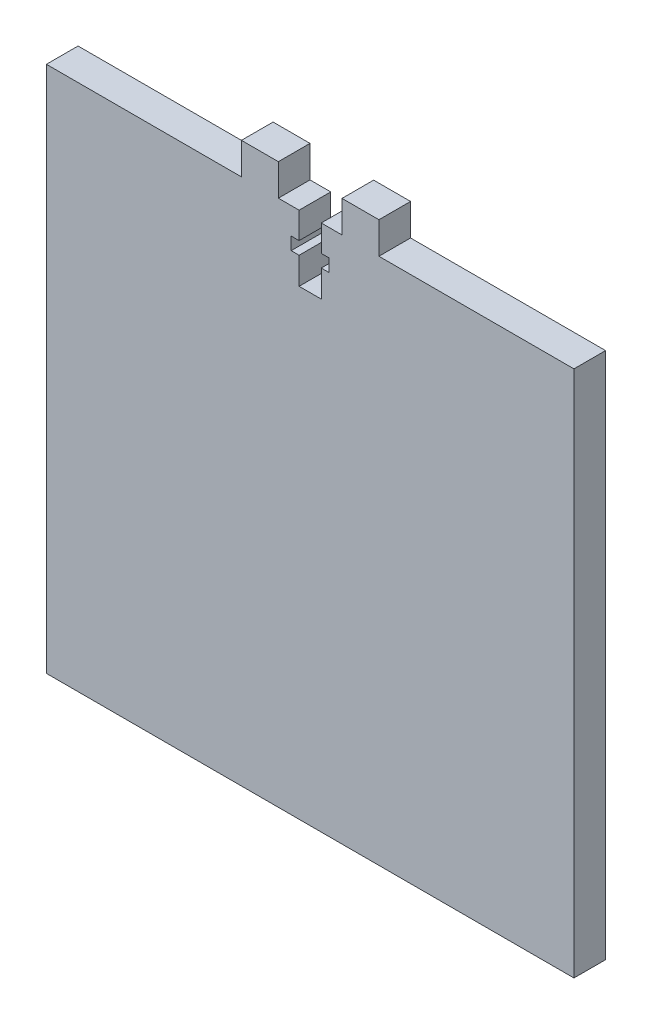
ISO-10303-21;
HEADER;
FILE_DESCRIPTION(('STEP AP214'),'2;1');
FILE_NAME('part.step','',(''),(''),'','','');
FILE_SCHEMA(('AUTOMOTIVE_DESIGN { 1 0 10303 214 1 1 1 1 }'));
ENDSEC;
DATA;
#1=APPLICATION_CONTEXT('core data for automotive mechanical design processes');
#2=APPLICATION_PROTOCOL_DEFINITION('international standard','automotive_design',2000,#1);
#3=PRODUCT_CONTEXT('',#1,'mechanical');
#4=PRODUCT('Part','Part','',(#3));
#5=PRODUCT_RELATED_PRODUCT_CATEGORY('part','',(#4));
#6=PRODUCT_DEFINITION_FORMATION('','',#4);
#7=PRODUCT_DEFINITION_CONTEXT('part definition',#1,'design');
#8=PRODUCT_DEFINITION('design','',#6,#7);
#9=PRODUCT_DEFINITION_SHAPE('','',#8);
#10=(LENGTH_UNIT() NAMED_UNIT(*) SI_UNIT(.MILLI.,.METRE.));
#11=(NAMED_UNIT(*) PLANE_ANGLE_UNIT() SI_UNIT($,.RADIAN.));
#12=(NAMED_UNIT(*) SI_UNIT($,.STERADIAN.) SOLID_ANGLE_UNIT());
#13=UNCERTAINTY_MEASURE_WITH_UNIT(LENGTH_MEASURE(1.E-05),#10,'distance_accuracy_value','');
#14=(GEOMETRIC_REPRESENTATION_CONTEXT(3) GLOBAL_UNCERTAINTY_ASSIGNED_CONTEXT((#13)) GLOBAL_UNIT_ASSIGNED_CONTEXT((#10,
#11,#12)) REPRESENTATION_CONTEXT('',''));
#15=CARTESIAN_POINT('',(0.,0.,0.));
#16=DIRECTION('',(0.,0.,1.));
#17=DIRECTION('',(1.,0.,0.));
#18=AXIS2_PLACEMENT_3D('',#15,#16,#17);
#19=CARTESIAN_POINT('',(-50.,50.,6.));
#20=DIRECTION('',(0.,-1.,0.));
#21=DIRECTION('',(0.,0.,-1.));
#22=AXIS2_PLACEMENT_3D('',#19,#20,#21);
#23=PLANE('',#22);
#24=DIRECTION('',(-1.,0.,0.));
#25=VECTOR('',#24,1.);
#26=CARTESIAN_POINT('',(-50.,50.,6.));
#27=LINE('',#26,#25);
#28=CARTESIAN_POINT('',(-2.10000000000001,50.,6.));
#29=VERTEX_POINT('',#28);
#30=CARTESIAN_POINT('',(-6.03184990821574,50.,6.));
#31=VERTEX_POINT('',#30);
#32=EDGE_CURVE('E358',#29,#31,#27,.T.);
#33=ORIENTED_EDGE('',*,*,#32,.F.);
#34=DIRECTION('',(0.,0.,1.));
#35=VECTOR('',#34,1.);
#36=CARTESIAN_POINT('',(-2.10000000000001,50.,0.));
#37=LINE('',#36,#35);
#38=CARTESIAN_POINT('',(-2.10000000000001,50.,0.));
#39=VERTEX_POINT('',#38);
#40=EDGE_CURVE('E275',#39,#29,#37,.T.);
#41=ORIENTED_EDGE('',*,*,#40,.F.);
#42=DIRECTION('',(-1.,0.,0.));
#43=VECTOR('',#42,1.);
#44=CARTESIAN_POINT('',(-50.,50.,0.));
#45=LINE('',#44,#43);
#46=CARTESIAN_POINT('',(-6.03184990821574,50.,0.));
#47=VERTEX_POINT('',#46);
#48=EDGE_CURVE('E219',#39,#47,#45,.T.);
#49=ORIENTED_EDGE('',*,*,#48,.T.);
#50=DIRECTION('',(0.,0.,1.));
#51=VECTOR('',#50,1.);
#52=CARTESIAN_POINT('',(-6.03184990821574,50.,0.));
#53=LINE('',#52,#51);
#54=EDGE_CURVE('E345',#47,#31,#53,.T.);
#55=ORIENTED_EDGE('',*,*,#54,.T.);
#56=EDGE_LOOP('',(#33,#41,#49,#55));
#57=FACE_BOUND('',#56,.T.);
#58=ADVANCED_FACE('F35',(#57),#23,.F.);
#59=CARTESIAN_POINT('',(50.,50.,0.));
#60=VERTEX_POINT('',#59);
#61=CARTESIAN_POINT('',(13.0318499082157,50.,0.));
#62=VERTEX_POINT('',#61);
#63=EDGE_CURVE('E366',#60,#62,#45,.T.);
#64=ORIENTED_EDGE('',*,*,#63,.T.);
#65=DIRECTION('',(0.,0.,1.));
#66=VECTOR('',#65,1.);
#67=CARTESIAN_POINT('',(13.0318499082157,50.,0.));
#68=LINE('',#67,#66);
#69=CARTESIAN_POINT('',(13.0318499082157,50.,6.));
#70=VERTEX_POINT('',#69);
#71=EDGE_CURVE('E315',#62,#70,#68,.T.);
#72=ORIENTED_EDGE('',*,*,#71,.T.);
#73=CARTESIAN_POINT('',(50.,50.,6.));
#74=VERTEX_POINT('',#73);
#75=EDGE_CURVE('E354',#74,#70,#27,.T.);
#76=ORIENTED_EDGE('',*,*,#75,.F.);
#77=DIRECTION('',(0.,0.,-1.));
#78=VECTOR('',#77,1.);
#79=CARTESIAN_POINT('',(50.,50.,6.));
#80=LINE('',#79,#78);
#81=EDGE_CURVE('E11',#74,#60,#80,.T.);
#82=ORIENTED_EDGE('',*,*,#81,.T.);
#83=EDGE_LOOP('',(#64,#72,#76,#82));
#84=FACE_BOUND('',#83,.T.);
#85=ADVANCED_FACE('F465',(#84),#23,.F.);
#86=DIRECTION('',(0.,0.,1.));
#87=VECTOR('',#86,1.);
#88=CARTESIAN_POINT('',(-13.0318499082157,50.,0.));
#89=LINE('',#88,#87);
#90=CARTESIAN_POINT('',(-13.0318499082157,50.,0.));
#91=VERTEX_POINT('',#90);
#92=CARTESIAN_POINT('',(-13.0318499082157,50.,6.));
#93=VERTEX_POINT('',#92);
#94=EDGE_CURVE('E332',#91,#93,#89,.T.);
#95=ORIENTED_EDGE('',*,*,#94,.F.);
#96=CARTESIAN_POINT('',(-50.,50.,0.));
#97=VERTEX_POINT('',#96);
#98=EDGE_CURVE('E365',#91,#97,#45,.T.);
#99=ORIENTED_EDGE('',*,*,#98,.T.);
#100=DIRECTION('',(0.,0.,-1.));
#101=VECTOR('',#100,1.);
#102=CARTESIAN_POINT('',(-50.,50.,6.));
#103=LINE('',#102,#101);
#104=CARTESIAN_POINT('',(-50.,50.,6.));
#105=VERTEX_POINT('',#104);
#106=EDGE_CURVE('E43',#105,#97,#103,.T.);
#107=ORIENTED_EDGE('',*,*,#106,.F.);
#108=EDGE_CURVE('E352',#93,#105,#27,.T.);
#109=ORIENTED_EDGE('',*,*,#108,.F.);
#110=EDGE_LOOP('',(#95,#99,#107,#109));
#111=FACE_BOUND('',#110,.T.);
#112=ADVANCED_FACE('F410',(#111),#23,.F.);
#113=CARTESIAN_POINT('',(50.,-50.,6.));
#114=DIRECTION('',(-1.,0.,0.));
#115=DIRECTION('',(0.,0.,1.));
#116=AXIS2_PLACEMENT_3D('',#113,#114,#115);
#117=PLANE('',#116);
#118=DIRECTION('',(0.,1.,0.));
#119=VECTOR('',#118,1.);
#120=CARTESIAN_POINT('',(50.,-50.,0.));
#121=LINE('',#120,#119);
#122=CARTESIAN_POINT('',(50.,-50.,0.));
#123=VERTEX_POINT('',#122);
#124=EDGE_CURVE('E342',#123,#60,#121,.T.);
#125=ORIENTED_EDGE('',*,*,#124,.T.);
#126=ORIENTED_EDGE('',*,*,#81,.F.);
#127=DIRECTION('',(0.,1.,0.));
#128=VECTOR('',#127,1.);
#129=CARTESIAN_POINT('',(50.,-50.,6.));
#130=LINE('',#129,#128);
#131=CARTESIAN_POINT('',(50.,-50.,6.));
#132=VERTEX_POINT('',#131);
#133=EDGE_CURVE('E349',#132,#74,#130,.T.);
#134=ORIENTED_EDGE('',*,*,#133,.F.);
#135=DIRECTION('',(0.,0.,-1.));
#136=VECTOR('',#135,1.);
#137=CARTESIAN_POINT('',(50.,-50.,6.));
#138=LINE('',#137,#136);
#139=EDGE_CURVE('E362',#132,#123,#138,.T.);
#140=ORIENTED_EDGE('',*,*,#139,.T.);
#141=EDGE_LOOP('',(#125,#126,#134,#140));
#142=FACE_BOUND('',#141,.T.);
#143=ADVANCED_FACE('F37',(#142),#117,.F.);
#144=CARTESIAN_POINT('',(6.03184990821572,50.,0.));
#145=VERTEX_POINT('',#144);
#146=CARTESIAN_POINT('',(2.09999999999999,50.,0.));
#147=VERTEX_POINT('',#146);
#148=EDGE_CURVE('E369',#145,#147,#45,.T.);
#149=ORIENTED_EDGE('',*,*,#148,.T.);
#150=DIRECTION('',(0.,0.,1.));
#151=VECTOR('',#150,1.);
#152=CARTESIAN_POINT('',(2.09999999999999,50.,0.));
#153=LINE('',#152,#151);
#154=CARTESIAN_POINT('',(2.09999999999999,50.,6.));
#155=VERTEX_POINT('',#154);
#156=EDGE_CURVE('E278',#147,#155,#153,.T.);
#157=ORIENTED_EDGE('',*,*,#156,.T.);
#158=CARTESIAN_POINT('',(6.03184990821572,50.,6.));
#159=VERTEX_POINT('',#158);
#160=EDGE_CURVE('E58',#159,#155,#27,.T.);
#161=ORIENTED_EDGE('',*,*,#160,.F.);
#162=DIRECTION('',(0.,0.,1.));
#163=VECTOR('',#162,1.);
#164=CARTESIAN_POINT('',(6.03184990821572,50.,0.));
#165=LINE('',#164,#163);
#166=EDGE_CURVE('E318',#145,#159,#165,.T.);
#167=ORIENTED_EDGE('',*,*,#166,.F.);
#168=EDGE_LOOP('',(#149,#157,#161,#167));
#169=FACE_BOUND('',#168,.T.);
#170=ADVANCED_FACE('F409',(#169),#23,.F.);
#171=CARTESIAN_POINT('',(-50.,-50.,6.));
#172=DIRECTION('',(1.,0.,0.));
#173=DIRECTION('',(0.,0.,-1.));
#174=AXIS2_PLACEMENT_3D('',#171,#172,#173);
#175=PLANE('',#174);
#176=DIRECTION('',(0.,-1.,0.));
#177=VECTOR('',#176,1.);
#178=CARTESIAN_POINT('',(-50.,-50.,0.));
#179=LINE('',#178,#177);
#180=CARTESIAN_POINT('',(-50.,-50.,0.));
#181=VERTEX_POINT('',#180);
#182=EDGE_CURVE('E368',#97,#181,#179,.T.);
#183=ORIENTED_EDGE('',*,*,#182,.T.);
#184=DIRECTION('',(0.,0.,-1.));
#185=VECTOR('',#184,1.);
#186=CARTESIAN_POINT('',(-50.,-50.,6.));
#187=LINE('',#186,#185);
#188=CARTESIAN_POINT('',(-50.,-50.,6.));
#189=VERTEX_POINT('',#188);
#190=EDGE_CURVE('E374',#189,#181,#187,.T.);
#191=ORIENTED_EDGE('',*,*,#190,.F.);
#192=DIRECTION('',(0.,-1.,0.));
#193=VECTOR('',#192,1.);
#194=CARTESIAN_POINT('',(-50.,-50.,6.));
#195=LINE('',#194,#193);
#196=EDGE_CURVE('E357',#105,#189,#195,.T.);
#197=ORIENTED_EDGE('',*,*,#196,.F.);
#198=ORIENTED_EDGE('',*,*,#106,.T.);
#199=EDGE_LOOP('',(#183,#191,#197,#198));
#200=FACE_BOUND('',#199,.T.);
#201=ADVANCED_FACE('F381',(#200),#175,.F.);
#202=CARTESIAN_POINT('',(-50.,-50.,6.));
#203=DIRECTION('',(0.,1.,0.));
#204=DIRECTION('',(0.,0.,1.));
#205=AXIS2_PLACEMENT_3D('',#202,#203,#204);
#206=PLANE('',#205);
#207=DIRECTION('',(1.,0.,0.));
#208=VECTOR('',#207,1.);
#209=CARTESIAN_POINT('',(-50.,-50.,0.));
#210=LINE('',#209,#208);
#211=EDGE_CURVE('E353',#181,#123,#210,.T.);
#212=ORIENTED_EDGE('',*,*,#211,.T.);
#213=ORIENTED_EDGE('',*,*,#139,.F.);
#214=DIRECTION('',(1.,0.,0.));
#215=VECTOR('',#214,1.);
#216=CARTESIAN_POINT('',(-50.,-50.,6.));
#217=LINE('',#216,#215);
#218=EDGE_CURVE('E360',#189,#132,#217,.T.);
#219=ORIENTED_EDGE('',*,*,#218,.F.);
#220=ORIENTED_EDGE('',*,*,#190,.T.);
#221=EDGE_LOOP('',(#212,#213,#219,#220));
#222=FACE_BOUND('',#221,.T.);
#223=ADVANCED_FACE('F391',(#222),#206,.F.);
#224=CARTESIAN_POINT('',(0.,0.,6.));
#225=DIRECTION('',(0.,0.,-1.));
#226=DIRECTION('',(-1.,0.,0.));
#227=AXIS2_PLACEMENT_3D('',#224,#225,#226);
#228=PLANE('',#227);
#229=DIRECTION('',(-1.,0.,0.));
#230=VECTOR('',#229,1.);
#231=CARTESIAN_POINT('',(-2.10000000000001,45.,6.));
#232=LINE('',#231,#230);
#233=CARTESIAN_POINT('',(-2.10000000000001,45.,6.));
#234=VERTEX_POINT('',#233);
#235=CARTESIAN_POINT('',(-3.60000000000001,45.,6.));
#236=VERTEX_POINT('',#235);
#237=EDGE_CURVE('E250',#234,#236,#232,.T.);
#238=ORIENTED_EDGE('',*,*,#237,.F.);
#239=DIRECTION('',(0.,-1.,0.));
#240=VECTOR('',#239,1.);
#241=CARTESIAN_POINT('',(-2.10000000000001,45.,6.));
#242=LINE('',#241,#240);
#243=EDGE_CURVE('E204',#29,#234,#242,.T.);
#244=ORIENTED_EDGE('',*,*,#243,.F.);
#245=ORIENTED_EDGE('',*,*,#32,.T.);
#246=DIRECTION('',(0.,1.,0.));
#247=VECTOR('',#246,1.);
#248=CARTESIAN_POINT('',(-6.03184990821574,50.,6.));
#249=LINE('',#248,#247);
#250=CARTESIAN_POINT('',(-6.03184990821574,56.,6.));
#251=VERTEX_POINT('',#250);
#252=EDGE_CURVE('E335',#31,#251,#249,.T.);
#253=ORIENTED_EDGE('',*,*,#252,.T.);
#254=DIRECTION('',(-1.,0.,0.));
#255=VECTOR('',#254,1.);
#256=CARTESIAN_POINT('',(-13.0318499082157,56.,6.));
#257=LINE('',#256,#255);
#258=CARTESIAN_POINT('',(-13.0318499082157,56.,6.));
#259=VERTEX_POINT('',#258);
#260=EDGE_CURVE('E326',#251,#259,#257,.T.);
#261=ORIENTED_EDGE('',*,*,#260,.T.);
#262=DIRECTION('',(0.,-1.,0.));
#263=VECTOR('',#262,1.);
#264=CARTESIAN_POINT('',(-13.0318499082157,50.,6.));
#265=LINE('',#264,#263);
#266=EDGE_CURVE('E317',#259,#93,#265,.T.);
#267=ORIENTED_EDGE('',*,*,#266,.T.);
#268=ORIENTED_EDGE('',*,*,#108,.T.);
#269=ORIENTED_EDGE('',*,*,#196,.T.);
#270=ORIENTED_EDGE('',*,*,#218,.T.);
#271=ORIENTED_EDGE('',*,*,#133,.T.);
#272=ORIENTED_EDGE('',*,*,#75,.T.);
#273=DIRECTION('',(0.,1.,0.));
#274=VECTOR('',#273,1.);
#275=CARTESIAN_POINT('',(13.0318499082157,50.,6.));
#276=LINE('',#275,#274);
#277=CARTESIAN_POINT('',(13.0318499082157,56.,6.));
#278=VERTEX_POINT('',#277);
#279=EDGE_CURVE('E277',#70,#278,#276,.T.);
#280=ORIENTED_EDGE('',*,*,#279,.T.);
#281=DIRECTION('',(-1.,0.,0.));
#282=VECTOR('',#281,1.);
#283=CARTESIAN_POINT('',(13.0318499082157,56.,6.));
#284=LINE('',#283,#282);
#285=CARTESIAN_POINT('',(6.03184990821572,56.,6.));
#286=VERTEX_POINT('',#285);
#287=EDGE_CURVE('E310',#278,#286,#284,.T.);
#288=ORIENTED_EDGE('',*,*,#287,.T.);
#289=DIRECTION('',(0.,-1.,0.));
#290=VECTOR('',#289,1.);
#291=CARTESIAN_POINT('',(6.03184990821572,50.,6.));
#292=LINE('',#291,#290);
#293=EDGE_CURVE('E301',#286,#159,#292,.T.);
#294=ORIENTED_EDGE('',*,*,#293,.T.);
#295=ORIENTED_EDGE('',*,*,#160,.T.);
#296=DIRECTION('',(0.,1.,0.));
#297=VECTOR('',#296,1.);
#298=CARTESIAN_POINT('',(2.09999999999999,50.,6.));
#299=LINE('',#298,#297);
#300=CARTESIAN_POINT('',(2.09999999999999,45.,6.));
#301=VERTEX_POINT('',#300);
#302=EDGE_CURVE('E220',#301,#155,#299,.T.);
#303=ORIENTED_EDGE('',*,*,#302,.F.);
#304=DIRECTION('',(-1.,0.,0.));
#305=VECTOR('',#304,1.);
#306=CARTESIAN_POINT('',(2.09999999999999,45.,6.));
#307=LINE('',#306,#305);
#308=CARTESIAN_POINT('',(3.59999999999999,45.,6.));
#309=VERTEX_POINT('',#308);
#310=EDGE_CURVE('E222',#309,#301,#307,.T.);
#311=ORIENTED_EDGE('',*,*,#310,.F.);
#312=DIRECTION('',(0.,1.,0.));
#313=VECTOR('',#312,1.);
#314=CARTESIAN_POINT('',(3.59999999999999,45.,6.));
#315=LINE('',#314,#313);
#316=CARTESIAN_POINT('',(3.59999999999999,42.6,6.));
#317=VERTEX_POINT('',#316);
#318=EDGE_CURVE('E270',#317,#309,#315,.T.);
#319=ORIENTED_EDGE('',*,*,#318,.F.);
#320=DIRECTION('',(1.,0.,0.));
#321=VECTOR('',#320,1.);
#322=CARTESIAN_POINT('',(3.59999999999999,42.6,6.));
#323=LINE('',#322,#321);
#324=CARTESIAN_POINT('',(2.09999999999999,42.6,6.));
#325=VERTEX_POINT('',#324);
#326=EDGE_CURVE('E267',#325,#317,#323,.T.);
#327=ORIENTED_EDGE('',*,*,#326,.F.);
#328=DIRECTION('',(0.,1.,0.));
#329=VECTOR('',#328,1.);
#330=CARTESIAN_POINT('',(2.09999999999999,42.6,6.));
#331=LINE('',#330,#329);
#332=CARTESIAN_POINT('',(2.09999999999999,37.5,6.));
#333=VERTEX_POINT('',#332);
#334=EDGE_CURVE('E264',#333,#325,#331,.T.);
#335=ORIENTED_EDGE('',*,*,#334,.F.);
#336=DIRECTION('',(1.,0.,0.));
#337=VECTOR('',#336,1.);
#338=CARTESIAN_POINT('',(2.09999999999999,37.5,6.));
#339=LINE('',#338,#337);
#340=CARTESIAN_POINT('',(-2.10000000000001,37.5,6.));
#341=VERTEX_POINT('',#340);
#342=EDGE_CURVE('E261',#341,#333,#339,.T.);
#343=ORIENTED_EDGE('',*,*,#342,.F.);
#344=DIRECTION('',(0.,-1.,0.));
#345=VECTOR('',#344,1.);
#346=CARTESIAN_POINT('',(-2.10000000000001,37.5,6.));
#347=LINE('',#346,#345);
#348=CARTESIAN_POINT('',(-2.10000000000001,42.6,6.));
#349=VERTEX_POINT('',#348);
#350=EDGE_CURVE('E258',#349,#341,#347,.T.);
#351=ORIENTED_EDGE('',*,*,#350,.F.);
#352=DIRECTION('',(1.,0.,0.));
#353=VECTOR('',#352,1.);
#354=CARTESIAN_POINT('',(-3.60000000000001,42.6,6.));
#355=LINE('',#354,#353);
#356=CARTESIAN_POINT('',(-3.60000000000001,42.6,6.));
#357=VERTEX_POINT('',#356);
#358=EDGE_CURVE('E255',#357,#349,#355,.T.);
#359=ORIENTED_EDGE('',*,*,#358,.F.);
#360=DIRECTION('',(0.,-1.,0.));
#361=VECTOR('',#360,1.);
#362=CARTESIAN_POINT('',(-3.60000000000001,45.,6.));
#363=LINE('',#362,#361);
#364=EDGE_CURVE('E252',#236,#357,#363,.T.);
#365=ORIENTED_EDGE('',*,*,#364,.F.);
#366=EDGE_LOOP('',(#238,#244,#245,#253,#261,#267,#268,#269,#270,#271,#272,#280,#288,#294,#295,
#303,#311,#319,#327,#335,#343,#351,#359,#365));
#367=FACE_BOUND('',#366,.T.);
#368=ADVANCED_FACE('F397',(#367),#228,.F.);
#369=CARTESIAN_POINT('',(0.,0.,0.));
#370=DIRECTION('',(0.,0.,-1.));
#371=DIRECTION('',(-1.,0.,0.));
#372=AXIS2_PLACEMENT_3D('',#369,#370,#371);
#373=PLANE('',#372);
#374=DIRECTION('',(0.,-1.,0.));
#375=VECTOR('',#374,1.);
#376=CARTESIAN_POINT('',(-2.10000000000001,45.,0.));
#377=LINE('',#376,#375);
#378=CARTESIAN_POINT('',(-2.10000000000001,45.,0.));
#379=VERTEX_POINT('',#378);
#380=EDGE_CURVE('E201',#39,#379,#377,.T.);
#381=ORIENTED_EDGE('',*,*,#380,.T.);
#382=DIRECTION('',(-1.,0.,0.));
#383=VECTOR('',#382,1.);
#384=CARTESIAN_POINT('',(-2.10000000000001,45.,0.));
#385=LINE('',#384,#383);
#386=CARTESIAN_POINT('',(-3.60000000000001,45.,0.));
#387=VERTEX_POINT('',#386);
#388=EDGE_CURVE('E212',#379,#387,#385,.T.);
#389=ORIENTED_EDGE('',*,*,#388,.T.);
#390=DIRECTION('',(0.,-1.,0.));
#391=VECTOR('',#390,1.);
#392=CARTESIAN_POINT('',(-3.60000000000001,45.,0.));
#393=LINE('',#392,#391);
#394=CARTESIAN_POINT('',(-3.60000000000001,42.6,0.));
#395=VERTEX_POINT('',#394);
#396=EDGE_CURVE('E50',#387,#395,#393,.T.);
#397=ORIENTED_EDGE('',*,*,#396,.T.);
#398=DIRECTION('',(1.,0.,0.));
#399=VECTOR('',#398,1.);
#400=CARTESIAN_POINT('',(-3.60000000000001,42.6,0.));
#401=LINE('',#400,#399);
#402=CARTESIAN_POINT('',(-2.10000000000001,42.6,0.));
#403=VERTEX_POINT('',#402);
#404=EDGE_CURVE('E226',#395,#403,#401,.T.);
#405=ORIENTED_EDGE('',*,*,#404,.T.);
#406=DIRECTION('',(0.,-1.,0.));
#407=VECTOR('',#406,1.);
#408=CARTESIAN_POINT('',(-2.10000000000001,37.5,0.));
#409=LINE('',#408,#407);
#410=CARTESIAN_POINT('',(-2.10000000000001,37.5,0.));
#411=VERTEX_POINT('',#410);
#412=EDGE_CURVE('E229',#403,#411,#409,.T.);
#413=ORIENTED_EDGE('',*,*,#412,.T.);
#414=DIRECTION('',(1.,0.,0.));
#415=VECTOR('',#414,1.);
#416=CARTESIAN_POINT('',(2.09999999999999,37.5,0.));
#417=LINE('',#416,#415);
#418=CARTESIAN_POINT('',(2.09999999999999,37.5,0.));
#419=VERTEX_POINT('',#418);
#420=EDGE_CURVE('E232',#411,#419,#417,.T.);
#421=ORIENTED_EDGE('',*,*,#420,.T.);
#422=DIRECTION('',(0.,1.,0.));
#423=VECTOR('',#422,1.);
#424=CARTESIAN_POINT('',(2.09999999999999,42.6,0.));
#425=LINE('',#424,#423);
#426=CARTESIAN_POINT('',(2.09999999999999,42.6,0.));
#427=VERTEX_POINT('',#426);
#428=EDGE_CURVE('E235',#419,#427,#425,.T.);
#429=ORIENTED_EDGE('',*,*,#428,.T.);
#430=DIRECTION('',(1.,0.,0.));
#431=VECTOR('',#430,1.);
#432=CARTESIAN_POINT('',(3.59999999999999,42.6,0.));
#433=LINE('',#432,#431);
#434=CARTESIAN_POINT('',(3.59999999999999,42.6,0.));
#435=VERTEX_POINT('',#434);
#436=EDGE_CURVE('E238',#427,#435,#433,.T.);
#437=ORIENTED_EDGE('',*,*,#436,.T.);
#438=DIRECTION('',(0.,1.,0.));
#439=VECTOR('',#438,1.);
#440=CARTESIAN_POINT('',(3.59999999999999,45.,0.));
#441=LINE('',#440,#439);
#442=CARTESIAN_POINT('',(3.59999999999999,45.,0.));
#443=VERTEX_POINT('',#442);
#444=EDGE_CURVE('E241',#435,#443,#441,.T.);
#445=ORIENTED_EDGE('',*,*,#444,.T.);
#446=DIRECTION('',(-1.,0.,0.));
#447=VECTOR('',#446,1.);
#448=CARTESIAN_POINT('',(2.09999999999999,45.,0.));
#449=LINE('',#448,#447);
#450=CARTESIAN_POINT('',(2.09999999999999,45.,0.));
#451=VERTEX_POINT('',#450);
#452=EDGE_CURVE('E244',#443,#451,#449,.T.);
#453=ORIENTED_EDGE('',*,*,#452,.T.);
#454=DIRECTION('',(0.,1.,0.));
#455=VECTOR('',#454,1.);
#456=CARTESIAN_POINT('',(2.09999999999999,50.,0.));
#457=LINE('',#456,#455);
#458=EDGE_CURVE('E209',#451,#147,#457,.T.);
#459=ORIENTED_EDGE('',*,*,#458,.T.);
#460=ORIENTED_EDGE('',*,*,#148,.F.);
#461=DIRECTION('',(0.,-1.,0.));
#462=VECTOR('',#461,1.);
#463=CARTESIAN_POINT('',(6.03184990821572,50.,0.));
#464=LINE('',#463,#462);
#465=CARTESIAN_POINT('',(6.03184990821572,56.,0.));
#466=VERTEX_POINT('',#465);
#467=EDGE_CURVE('E304',#466,#145,#464,.T.);
#468=ORIENTED_EDGE('',*,*,#467,.F.);
#469=DIRECTION('',(-1.,0.,0.));
#470=VECTOR('',#469,1.);
#471=CARTESIAN_POINT('',(13.0318499082157,56.,0.));
#472=LINE('',#471,#470);
#473=CARTESIAN_POINT('',(13.0318499082157,56.,0.));
#474=VERTEX_POINT('',#473);
#475=EDGE_CURVE('E300',#474,#466,#472,.T.);
#476=ORIENTED_EDGE('',*,*,#475,.F.);
#477=DIRECTION('',(0.,1.,0.));
#478=VECTOR('',#477,1.);
#479=CARTESIAN_POINT('',(13.0318499082157,50.,0.));
#480=LINE('',#479,#478);
#481=EDGE_CURVE('E297',#62,#474,#480,.T.);
#482=ORIENTED_EDGE('',*,*,#481,.F.);
#483=ORIENTED_EDGE('',*,*,#63,.F.);
#484=ORIENTED_EDGE('',*,*,#124,.F.);
#485=ORIENTED_EDGE('',*,*,#211,.F.);
#486=ORIENTED_EDGE('',*,*,#182,.F.);
#487=ORIENTED_EDGE('',*,*,#98,.F.);
#488=DIRECTION('',(0.,-1.,0.));
#489=VECTOR('',#488,1.);
#490=CARTESIAN_POINT('',(-13.0318499082157,50.,0.));
#491=LINE('',#490,#489);
#492=CARTESIAN_POINT('',(-13.0318499082157,56.,0.));
#493=VERTEX_POINT('',#492);
#494=EDGE_CURVE('E323',#493,#91,#491,.T.);
#495=ORIENTED_EDGE('',*,*,#494,.F.);
#496=DIRECTION('',(-1.,0.,0.));
#497=VECTOR('',#496,1.);
#498=CARTESIAN_POINT('',(-13.0318499082157,56.,0.));
#499=LINE('',#498,#497);
#500=CARTESIAN_POINT('',(-6.03184990821574,56.,0.));
#501=VERTEX_POINT('',#500);
#502=EDGE_CURVE('E329',#501,#493,#499,.T.);
#503=ORIENTED_EDGE('',*,*,#502,.F.);
#504=DIRECTION('',(0.,1.,0.));
#505=VECTOR('',#504,1.);
#506=CARTESIAN_POINT('',(-6.03184990821574,50.,0.));
#507=LINE('',#506,#505);
#508=EDGE_CURVE('E325',#47,#501,#507,.T.);
#509=ORIENTED_EDGE('',*,*,#508,.F.);
#510=ORIENTED_EDGE('',*,*,#48,.F.);
#511=EDGE_LOOP('',(#381,#389,#397,#405,#413,#421,#429,#437,#445,#453,#459,#460,#468,#476,#482,
#483,#484,#485,#486,#487,#495,#503,#509,#510));
#512=FACE_BOUND('',#511,.T.);
#513=ADVANCED_FACE('F217',(#512),#373,.T.);
#514=CARTESIAN_POINT('',(-13.0318499082157,50.,0.));
#515=DIRECTION('',(-1.,0.,0.));
#516=DIRECTION('',(0.,0.,1.));
#517=AXIS2_PLACEMENT_3D('',#514,#515,#516);
#518=PLANE('',#517);
#519=ORIENTED_EDGE('',*,*,#266,.F.);
#520=DIRECTION('',(0.,0.,1.));
#521=VECTOR('',#520,1.);
#522=CARTESIAN_POINT('',(-13.0318499082157,56.,0.));
#523=LINE('',#522,#521);
#524=EDGE_CURVE('E340',#493,#259,#523,.T.);
#525=ORIENTED_EDGE('',*,*,#524,.F.);
#526=ORIENTED_EDGE('',*,*,#494,.T.);
#527=ORIENTED_EDGE('',*,*,#94,.T.);
#528=EDGE_LOOP('',(#519,#525,#526,#527));
#529=FACE_BOUND('',#528,.T.);
#530=ADVANCED_FACE('F412',(#529),#518,.T.);
#531=CARTESIAN_POINT('',(-13.0318499082157,56.,0.));
#532=DIRECTION('',(0.,1.,0.));
#533=DIRECTION('',(0.,0.,1.));
#534=AXIS2_PLACEMENT_3D('',#531,#532,#533);
#535=PLANE('',#534);
#536=ORIENTED_EDGE('',*,*,#260,.F.);
#537=DIRECTION('',(0.,0.,1.));
#538=VECTOR('',#537,1.);
#539=CARTESIAN_POINT('',(-6.03184990821574,56.,0.));
#540=LINE('',#539,#538);
#541=EDGE_CURVE('E343',#501,#251,#540,.T.);
#542=ORIENTED_EDGE('',*,*,#541,.F.);
#543=ORIENTED_EDGE('',*,*,#502,.T.);
#544=ORIENTED_EDGE('',*,*,#524,.T.);
#545=EDGE_LOOP('',(#536,#542,#543,#544));
#546=FACE_BOUND('',#545,.T.);
#547=ADVANCED_FACE('F416',(#546),#535,.T.);
#548=CARTESIAN_POINT('',(-6.03184990821574,50.,0.));
#549=DIRECTION('',(1.,0.,0.));
#550=DIRECTION('',(0.,1.,0.));
#551=AXIS2_PLACEMENT_3D('',#548,#549,#550);
#552=PLANE('',#551);
#553=ORIENTED_EDGE('',*,*,#252,.F.);
#554=ORIENTED_EDGE('',*,*,#54,.F.);
#555=ORIENTED_EDGE('',*,*,#508,.T.);
#556=ORIENTED_EDGE('',*,*,#541,.T.);
#557=EDGE_LOOP('',(#553,#554,#555,#556));
#558=FACE_BOUND('',#557,.T.);
#559=ADVANCED_FACE('F420',(#558),#552,.T.);
#560=CARTESIAN_POINT('',(13.0318499082157,50.,0.));
#561=DIRECTION('',(1.,0.,0.));
#562=DIRECTION('',(0.,0.,-1.));
#563=AXIS2_PLACEMENT_3D('',#560,#561,#562);
#564=PLANE('',#563);
#565=ORIENTED_EDGE('',*,*,#279,.F.);
#566=ORIENTED_EDGE('',*,*,#71,.F.);
#567=ORIENTED_EDGE('',*,*,#481,.T.);
#568=DIRECTION('',(0.,0.,1.));
#569=VECTOR('',#568,1.);
#570=CARTESIAN_POINT('',(13.0318499082157,56.,0.));
#571=LINE('',#570,#569);
#572=EDGE_CURVE('E307',#474,#278,#571,.T.);
#573=ORIENTED_EDGE('',*,*,#572,.T.);
#574=EDGE_LOOP('',(#565,#566,#567,#573));
#575=FACE_BOUND('',#574,.T.);
#576=ADVANCED_FACE('F557',(#575),#564,.T.);
#577=CARTESIAN_POINT('',(6.03184990821572,50.,0.));
#578=DIRECTION('',(-1.,0.,0.));
#579=DIRECTION('',(0.,0.,1.));
#580=AXIS2_PLACEMENT_3D('',#577,#578,#579);
#581=PLANE('',#580);
#582=ORIENTED_EDGE('',*,*,#293,.F.);
#583=DIRECTION('',(0.,0.,1.));
#584=VECTOR('',#583,1.);
#585=CARTESIAN_POINT('',(6.03184990821572,56.,0.));
#586=LINE('',#585,#584);
#587=EDGE_CURVE('E320',#466,#286,#586,.T.);
#588=ORIENTED_EDGE('',*,*,#587,.F.);
#589=ORIENTED_EDGE('',*,*,#467,.T.);
#590=ORIENTED_EDGE('',*,*,#166,.T.);
#591=EDGE_LOOP('',(#582,#588,#589,#590));
#592=FACE_BOUND('',#591,.T.);
#593=ADVANCED_FACE('F406',(#592),#581,.T.);
#594=CARTESIAN_POINT('',(13.0318499082157,56.,0.));
#595=DIRECTION('',(0.,1.,0.));
#596=DIRECTION('',(0.,0.,1.));
#597=AXIS2_PLACEMENT_3D('',#594,#595,#596);
#598=PLANE('',#597);
#599=ORIENTED_EDGE('',*,*,#287,.F.);
#600=ORIENTED_EDGE('',*,*,#572,.F.);
#601=ORIENTED_EDGE('',*,*,#475,.T.);
#602=ORIENTED_EDGE('',*,*,#587,.T.);
#603=EDGE_LOOP('',(#599,#600,#601,#602));
#604=FACE_BOUND('',#603,.T.);
#605=ADVANCED_FACE('F462',(#604),#598,.T.);
#606=CARTESIAN_POINT('',(-2.10000000000001,45.,0.));
#607=DIRECTION('',(-1.,0.,0.));
#608=DIRECTION('',(0.,-1.,0.));
#609=AXIS2_PLACEMENT_3D('',#606,#607,#608);
#610=PLANE('',#609);
#611=ORIENTED_EDGE('',*,*,#243,.T.);
#612=DIRECTION('',(0.,0.,1.));
#613=VECTOR('',#612,1.);
#614=CARTESIAN_POINT('',(-2.10000000000001,45.,0.));
#615=LINE('',#614,#613);
#616=EDGE_CURVE('E197',#379,#234,#615,.T.);
#617=ORIENTED_EDGE('',*,*,#616,.F.);
#618=ORIENTED_EDGE('',*,*,#380,.F.);
#619=ORIENTED_EDGE('',*,*,#40,.T.);
#620=EDGE_LOOP('',(#611,#617,#618,#619));
#621=FACE_BOUND('',#620,.T.);
#622=ADVANCED_FACE('F199',(#621),#610,.F.);
#623=CARTESIAN_POINT('',(2.09999999999999,50.,0.));
#624=DIRECTION('',(1.,0.,0.));
#625=DIRECTION('',(0.,1.,0.));
#626=AXIS2_PLACEMENT_3D('',#623,#624,#625);
#627=PLANE('',#626);
#628=ORIENTED_EDGE('',*,*,#302,.T.);
#629=ORIENTED_EDGE('',*,*,#156,.F.);
#630=ORIENTED_EDGE('',*,*,#458,.F.);
#631=DIRECTION('',(0.,0.,1.));
#632=VECTOR('',#631,1.);
#633=CARTESIAN_POINT('',(2.09999999999999,45.,0.));
#634=LINE('',#633,#632);
#635=EDGE_CURVE('E280',#451,#301,#634,.T.);
#636=ORIENTED_EDGE('',*,*,#635,.T.);
#637=EDGE_LOOP('',(#628,#629,#630,#636));
#638=FACE_BOUND('',#637,.T.);
#639=ADVANCED_FACE('F454',(#638),#627,.F.);
#640=CARTESIAN_POINT('',(2.09999999999999,45.,0.));
#641=DIRECTION('',(0.,1.,0.));
#642=DIRECTION('',(0.,0.,1.));
#643=AXIS2_PLACEMENT_3D('',#640,#641,#642);
#644=PLANE('',#643);
#645=ORIENTED_EDGE('',*,*,#310,.T.);
#646=ORIENTED_EDGE('',*,*,#635,.F.);
#647=ORIENTED_EDGE('',*,*,#452,.F.);
#648=DIRECTION('',(0.,0.,1.));
#649=VECTOR('',#648,1.);
#650=CARTESIAN_POINT('',(3.59999999999999,45.,0.));
#651=LINE('',#650,#649);
#652=EDGE_CURVE('E282',#443,#309,#651,.T.);
#653=ORIENTED_EDGE('',*,*,#652,.T.);
#654=EDGE_LOOP('',(#645,#646,#647,#653));
#655=FACE_BOUND('',#654,.T.);
#656=ADVANCED_FACE('F451',(#655),#644,.F.);
#657=CARTESIAN_POINT('',(3.59999999999999,45.,0.));
#658=DIRECTION('',(1.,0.,0.));
#659=DIRECTION('',(0.,1.,0.));
#660=AXIS2_PLACEMENT_3D('',#657,#658,#659);
#661=PLANE('',#660);
#662=ORIENTED_EDGE('',*,*,#318,.T.);
#663=ORIENTED_EDGE('',*,*,#652,.F.);
#664=ORIENTED_EDGE('',*,*,#444,.F.);
#665=DIRECTION('',(0.,0.,1.));
#666=VECTOR('',#665,1.);
#667=CARTESIAN_POINT('',(3.59999999999999,42.6,0.));
#668=LINE('',#667,#666);
#669=EDGE_CURVE('E284',#435,#317,#668,.T.);
#670=ORIENTED_EDGE('',*,*,#669,.T.);
#671=EDGE_LOOP('',(#662,#663,#664,#670));
#672=FACE_BOUND('',#671,.T.);
#673=ADVANCED_FACE('F448',(#672),#661,.F.);
#674=CARTESIAN_POINT('',(3.59999999999999,42.6,0.));
#675=DIRECTION('',(0.,-1.,0.));
#676=DIRECTION('',(0.,0.,-1.));
#677=AXIS2_PLACEMENT_3D('',#674,#675,#676);
#678=PLANE('',#677);
#679=ORIENTED_EDGE('',*,*,#326,.T.);
#680=ORIENTED_EDGE('',*,*,#669,.F.);
#681=ORIENTED_EDGE('',*,*,#436,.F.);
#682=DIRECTION('',(0.,0.,1.));
#683=VECTOR('',#682,1.);
#684=CARTESIAN_POINT('',(2.09999999999999,42.6,0.));
#685=LINE('',#684,#683);
#686=EDGE_CURVE('E286',#427,#325,#685,.T.);
#687=ORIENTED_EDGE('',*,*,#686,.T.);
#688=EDGE_LOOP('',(#679,#680,#681,#687));
#689=FACE_BOUND('',#688,.T.);
#690=ADVANCED_FACE('F444',(#689),#678,.F.);
#691=CARTESIAN_POINT('',(2.09999999999999,42.6,0.));
#692=DIRECTION('',(1.,0.,0.));
#693=DIRECTION('',(0.,1.,0.));
#694=AXIS2_PLACEMENT_3D('',#691,#692,#693);
#695=PLANE('',#694);
#696=ORIENTED_EDGE('',*,*,#334,.T.);
#697=ORIENTED_EDGE('',*,*,#686,.F.);
#698=ORIENTED_EDGE('',*,*,#428,.F.);
#699=DIRECTION('',(0.,0.,1.));
#700=VECTOR('',#699,1.);
#701=CARTESIAN_POINT('',(2.09999999999999,37.5,0.));
#702=LINE('',#701,#700);
#703=EDGE_CURVE('E288',#419,#333,#702,.T.);
#704=ORIENTED_EDGE('',*,*,#703,.T.);
#705=EDGE_LOOP('',(#696,#697,#698,#704));
#706=FACE_BOUND('',#705,.T.);
#707=ADVANCED_FACE('F440',(#706),#695,.F.);
#708=CARTESIAN_POINT('',(2.09999999999999,37.5,0.));
#709=DIRECTION('',(0.,-1.,0.));
#710=DIRECTION('',(0.,0.,-1.));
#711=AXIS2_PLACEMENT_3D('',#708,#709,#710);
#712=PLANE('',#711);
#713=ORIENTED_EDGE('',*,*,#342,.T.);
#714=ORIENTED_EDGE('',*,*,#703,.F.);
#715=ORIENTED_EDGE('',*,*,#420,.F.);
#716=DIRECTION('',(0.,0.,1.));
#717=VECTOR('',#716,1.);
#718=CARTESIAN_POINT('',(-2.10000000000001,37.5,0.));
#719=LINE('',#718,#717);
#720=EDGE_CURVE('E290',#411,#341,#719,.T.);
#721=ORIENTED_EDGE('',*,*,#720,.T.);
#722=EDGE_LOOP('',(#713,#714,#715,#721));
#723=FACE_BOUND('',#722,.T.);
#724=ADVANCED_FACE('F436',(#723),#712,.F.);
#725=CARTESIAN_POINT('',(-2.10000000000001,37.5,0.));
#726=DIRECTION('',(-1.,0.,0.));
#727=DIRECTION('',(0.,-1.,0.));
#728=AXIS2_PLACEMENT_3D('',#725,#726,#727);
#729=PLANE('',#728);
#730=ORIENTED_EDGE('',*,*,#350,.T.);
#731=ORIENTED_EDGE('',*,*,#720,.F.);
#732=ORIENTED_EDGE('',*,*,#412,.F.);
#733=DIRECTION('',(0.,0.,1.));
#734=VECTOR('',#733,1.);
#735=CARTESIAN_POINT('',(-2.10000000000001,42.6,0.));
#736=LINE('',#735,#734);
#737=EDGE_CURVE('E292',#403,#349,#736,.T.);
#738=ORIENTED_EDGE('',*,*,#737,.T.);
#739=EDGE_LOOP('',(#730,#731,#732,#738));
#740=FACE_BOUND('',#739,.T.);
#741=ADVANCED_FACE('F433',(#740),#729,.F.);
#742=CARTESIAN_POINT('',(-3.60000000000001,42.6,0.));
#743=DIRECTION('',(0.,-1.,0.));
#744=DIRECTION('',(0.,0.,-1.));
#745=AXIS2_PLACEMENT_3D('',#742,#743,#744);
#746=PLANE('',#745);
#747=ORIENTED_EDGE('',*,*,#358,.T.);
#748=ORIENTED_EDGE('',*,*,#737,.F.);
#749=ORIENTED_EDGE('',*,*,#404,.F.);
#750=DIRECTION('',(0.,0.,1.));
#751=VECTOR('',#750,1.);
#752=CARTESIAN_POINT('',(-3.60000000000001,42.6,0.));
#753=LINE('',#752,#751);
#754=EDGE_CURVE('E294',#395,#357,#753,.T.);
#755=ORIENTED_EDGE('',*,*,#754,.T.);
#756=EDGE_LOOP('',(#747,#748,#749,#755));
#757=FACE_BOUND('',#756,.T.);
#758=ADVANCED_FACE('F429',(#757),#746,.F.);
#759=CARTESIAN_POINT('',(-3.60000000000001,45.,0.));
#760=DIRECTION('',(-1.,0.,0.));
#761=DIRECTION('',(0.,-1.,0.));
#762=AXIS2_PLACEMENT_3D('',#759,#760,#761);
#763=PLANE('',#762);
#764=ORIENTED_EDGE('',*,*,#364,.T.);
#765=ORIENTED_EDGE('',*,*,#754,.F.);
#766=ORIENTED_EDGE('',*,*,#396,.F.);
#767=DIRECTION('',(0.,0.,1.));
#768=VECTOR('',#767,1.);
#769=CARTESIAN_POINT('',(-3.60000000000001,45.,0.));
#770=LINE('',#769,#768);
#771=EDGE_CURVE('E208',#387,#236,#770,.T.);
#772=ORIENTED_EDGE('',*,*,#771,.T.);
#773=EDGE_LOOP('',(#764,#765,#766,#772));
#774=FACE_BOUND('',#773,.T.);
#775=ADVANCED_FACE('F426',(#774),#763,.F.);
#776=CARTESIAN_POINT('',(-2.10000000000001,45.,0.));
#777=DIRECTION('',(0.,1.,0.));
#778=DIRECTION('',(0.,0.,1.));
#779=AXIS2_PLACEMENT_3D('',#776,#777,#778);
#780=PLANE('',#779);
#781=ORIENTED_EDGE('',*,*,#237,.T.);
#782=ORIENTED_EDGE('',*,*,#771,.F.);
#783=ORIENTED_EDGE('',*,*,#388,.F.);
#784=ORIENTED_EDGE('',*,*,#616,.T.);
#785=EDGE_LOOP('',(#781,#782,#783,#784));
#786=FACE_BOUND('',#785,.T.);
#787=ADVANCED_FACE('F213',(#786),#780,.F.);
#788=CLOSED_SHELL('',(#58,#85,#112,#143,#170,#201,#223,#368,#513,#530,#547,#559,#576,#593,#605,
#622,#639,#656,#673,#690,#707,#724,#741,#758,#775,#787));
#789=MANIFOLD_SOLID_BREP('B2',#788);
#790=ADVANCED_BREP_SHAPE_REPRESENTATION('',(#18,#789),#14);
#791=SHAPE_DEFINITION_REPRESENTATION(#9,#790);
ENDSEC;
END-ISO-10303-21;
